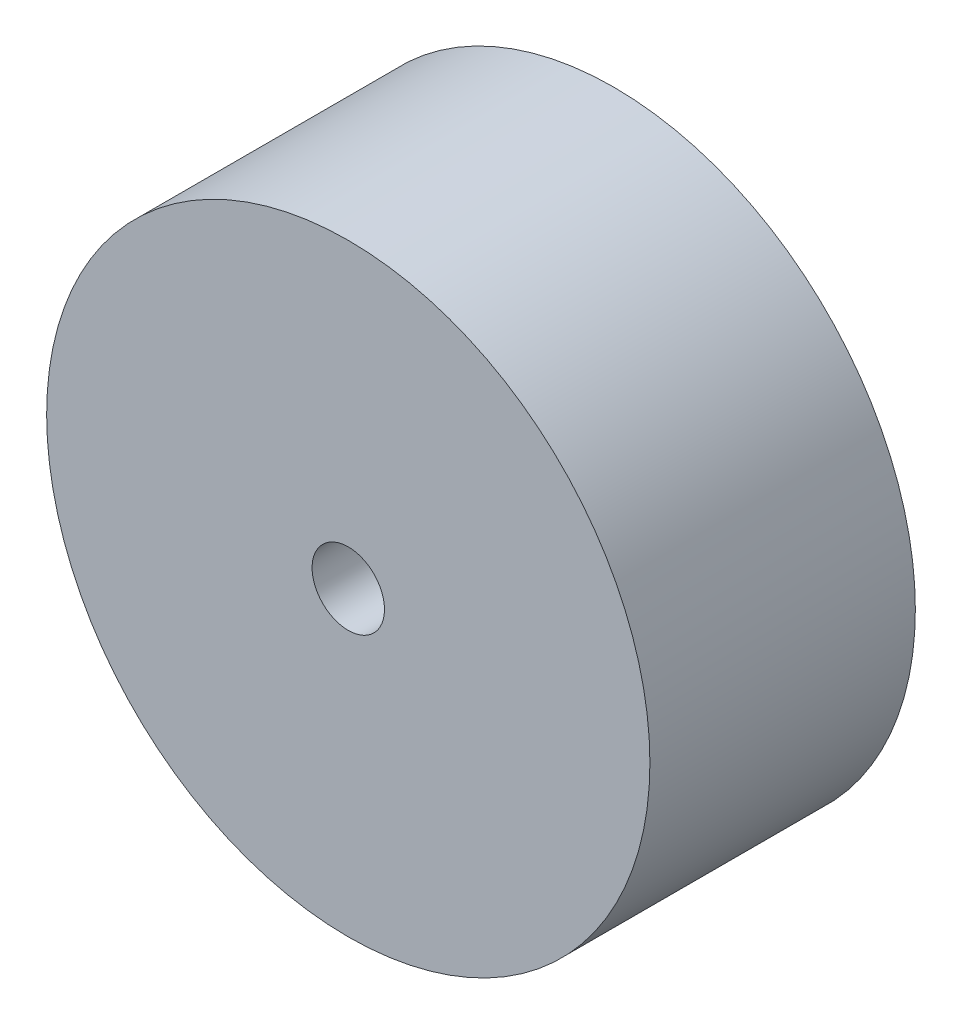
ISO-10303-21;
HEADER;
FILE_DESCRIPTION(('STEP AP214'),'2;1');
FILE_NAME('part.step','',(''),(''),'','','');
FILE_SCHEMA(('AUTOMOTIVE_DESIGN { 1 0 10303 214 1 1 1 1 }'));
ENDSEC;
DATA;
#1=APPLICATION_CONTEXT('core data for automotive mechanical design processes');
#2=APPLICATION_PROTOCOL_DEFINITION('international standard','automotive_design',2000,#1);
#3=PRODUCT_CONTEXT('',#1,'mechanical');
#4=PRODUCT('Part','Part','',(#3));
#5=PRODUCT_RELATED_PRODUCT_CATEGORY('part','',(#4));
#6=PRODUCT_DEFINITION_FORMATION('','',#4);
#7=PRODUCT_DEFINITION_CONTEXT('part definition',#1,'design');
#8=PRODUCT_DEFINITION('design','',#6,#7);
#9=PRODUCT_DEFINITION_SHAPE('','',#8);
#10=(LENGTH_UNIT() NAMED_UNIT(*) SI_UNIT(.MILLI.,.METRE.));
#11=(NAMED_UNIT(*) PLANE_ANGLE_UNIT() SI_UNIT($,.RADIAN.));
#12=(NAMED_UNIT(*) SI_UNIT($,.STERADIAN.) SOLID_ANGLE_UNIT());
#13=UNCERTAINTY_MEASURE_WITH_UNIT(LENGTH_MEASURE(1.E-05),#10,'distance_accuracy_value','');
#14=(GEOMETRIC_REPRESENTATION_CONTEXT(3) GLOBAL_UNCERTAINTY_ASSIGNED_CONTEXT((#13)) GLOBAL_UNIT_ASSIGNED_CONTEXT((#10,
#11,#12)) REPRESENTATION_CONTEXT('',''));
#15=CARTESIAN_POINT('',(0.,0.,0.));
#16=DIRECTION('',(0.,0.,1.));
#17=DIRECTION('',(1.,0.,0.));
#18=AXIS2_PLACEMENT_3D('',#15,#16,#17);
#19=CARTESIAN_POINT('',(0.,0.,4.4));
#20=DIRECTION('',(0.,0.,1.));
#21=DIRECTION('',(1.,0.,0.));
#22=AXIS2_PLACEMENT_3D('',#19,#20,#21);
#23=PLANE('',#22);
#24=CARTESIAN_POINT('',(0.,0.,4.4));
#25=DIRECTION('',(0.,0.,1.));
#26=DIRECTION('',(1.,0.,0.));
#27=AXIS2_PLACEMENT_3D('',#24,#25,#26);
#28=CIRCLE('',#27,5.);
#29=CARTESIAN_POINT('',(5.,0.,4.4));
#30=VERTEX_POINT('',#29);
#31=EDGE_CURVE('E10',#30,#30,#28,.T.);
#32=ORIENTED_EDGE('',*,*,#31,.T.);
#33=EDGE_LOOP('',(#32));
#34=FACE_BOUND('',#33,.T.);
#35=CARTESIAN_POINT('',(0.,0.,4.4));
#36=DIRECTION('',(0.,0.,1.));
#37=DIRECTION('',(1.,0.,0.));
#38=AXIS2_PLACEMENT_3D('',#35,#36,#37);
#39=CIRCLE('',#38,0.6);
#40=CARTESIAN_POINT('',(0.6,0.,4.4));
#41=VERTEX_POINT('',#40);
#42=EDGE_CURVE('E44',#41,#41,#39,.T.);
#43=ORIENTED_EDGE('',*,*,#42,.F.);
#44=EDGE_LOOP('',(#43));
#45=FACE_BOUND('',#44,.T.);
#46=ADVANCED_FACE('F33',(#34,#45),#23,.T.);
#47=CARTESIAN_POINT('',(0.,0.,0.));
#48=DIRECTION('',(0.,0.,1.));
#49=DIRECTION('',(1.,0.,0.));
#50=AXIS2_PLACEMENT_3D('',#47,#48,#49);
#51=PLANE('',#50);
#52=CARTESIAN_POINT('',(0.,0.,0.));
#53=DIRECTION('',(0.,0.,1.));
#54=DIRECTION('',(1.,0.,0.));
#55=AXIS2_PLACEMENT_3D('',#52,#53,#54);
#56=CIRCLE('',#55,5.);
#57=CARTESIAN_POINT('',(5.,0.,0.));
#58=VERTEX_POINT('',#57);
#59=EDGE_CURVE('E37',#58,#58,#56,.T.);
#60=ORIENTED_EDGE('',*,*,#59,.F.);
#61=EDGE_LOOP('',(#60));
#62=FACE_BOUND('',#61,.T.);
#63=CARTESIAN_POINT('',(0.,0.,0.));
#64=DIRECTION('',(0.,0.,1.));
#65=DIRECTION('',(1.,0.,0.));
#66=AXIS2_PLACEMENT_3D('',#63,#64,#65);
#67=CIRCLE('',#66,0.6);
#68=CARTESIAN_POINT('',(0.6,0.,0.));
#69=VERTEX_POINT('',#68);
#70=EDGE_CURVE('E46',#69,#69,#67,.T.);
#71=ORIENTED_EDGE('',*,*,#70,.T.);
#72=EDGE_LOOP('',(#71));
#73=FACE_BOUND('',#72,.T.);
#74=ADVANCED_FACE('F56',(#62,#73),#51,.F.);
#75=CARTESIAN_POINT('',(0.,0.,4.4));
#76=DIRECTION('',(0.,0.,-1.));
#77=DIRECTION('',(-1.,0.,0.));
#78=AXIS2_PLACEMENT_3D('',#75,#76,#77);
#79=CYLINDRICAL_SURFACE('',#78,5.);
#80=ORIENTED_EDGE('',*,*,#31,.F.);
#81=EDGE_LOOP('',(#80));
#82=FACE_BOUND('',#81,.T.);
#83=ORIENTED_EDGE('',*,*,#59,.T.);
#84=EDGE_LOOP('',(#83));
#85=FACE_BOUND('',#84,.T.);
#86=ADVANCED_FACE('F35',(#82,#85),#79,.T.);
#87=CARTESIAN_POINT('',(0.,0.,4.4));
#88=DIRECTION('',(0.,0.,-1.));
#89=DIRECTION('',(-1.,0.,0.));
#90=AXIS2_PLACEMENT_3D('',#87,#88,#89);
#91=CYLINDRICAL_SURFACE('',#90,0.6);
#92=ORIENTED_EDGE('',*,*,#42,.T.);
#93=EDGE_LOOP('',(#92));
#94=FACE_BOUND('',#93,.T.);
#95=ORIENTED_EDGE('',*,*,#70,.F.);
#96=EDGE_LOOP('',(#95));
#97=FACE_BOUND('',#96,.T.);
#98=ADVANCED_FACE('F52',(#94,#97),#91,.F.);
#99=CLOSED_SHELL('',(#46,#74,#86,#98));
#100=MANIFOLD_SOLID_BREP('B2',#99);
#101=ADVANCED_BREP_SHAPE_REPRESENTATION('',(#18,#100),#14);
#102=SHAPE_DEFINITION_REPRESENTATION(#9,#101);
ENDSEC;
END-ISO-10303-21;
